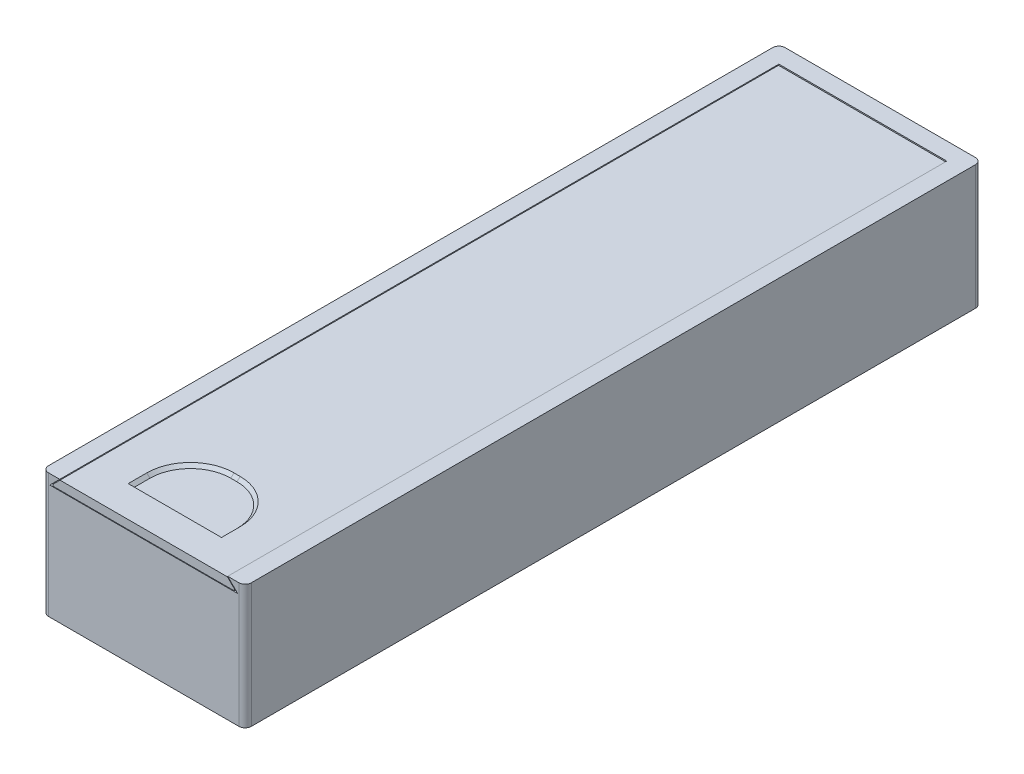
ISO-10303-21;
HEADER;
FILE_DESCRIPTION(('STEP AP214'),'2;1');
FILE_NAME('part.step','',(''),(''),'','','');
FILE_SCHEMA(('AUTOMOTIVE_DESIGN { 1 0 10303 214 1 1 1 1 }'));
ENDSEC;
DATA;
#1=APPLICATION_CONTEXT('core data for automotive mechanical design processes');
#2=APPLICATION_PROTOCOL_DEFINITION('international standard','automotive_design',2000,#1);
#3=PRODUCT_CONTEXT('',#1,'mechanical');
#4=PRODUCT('Part','Part','',(#3));
#5=PRODUCT_RELATED_PRODUCT_CATEGORY('part','',(#4));
#6=PRODUCT_DEFINITION_FORMATION('','',#4);
#7=PRODUCT_DEFINITION_CONTEXT('part definition',#1,'design');
#8=PRODUCT_DEFINITION('design','',#6,#7);
#9=PRODUCT_DEFINITION_SHAPE('','',#8);
#10=(LENGTH_UNIT() NAMED_UNIT(*) SI_UNIT(.MILLI.,.METRE.));
#11=(NAMED_UNIT(*) PLANE_ANGLE_UNIT() SI_UNIT($,.RADIAN.));
#12=(NAMED_UNIT(*) SI_UNIT($,.STERADIAN.) SOLID_ANGLE_UNIT());
#13=UNCERTAINTY_MEASURE_WITH_UNIT(LENGTH_MEASURE(1.E-05),#10,'distance_accuracy_value','');
#14=(GEOMETRIC_REPRESENTATION_CONTEXT(3) GLOBAL_UNCERTAINTY_ASSIGNED_CONTEXT((#13)) GLOBAL_UNIT_ASSIGNED_CONTEXT((#10,
#11,#12)) REPRESENTATION_CONTEXT('',''));
#15=CARTESIAN_POINT('',(0.,0.,0.));
#16=DIRECTION('',(0.,0.,1.));
#17=DIRECTION('',(1.,0.,0.));
#18=AXIS2_PLACEMENT_3D('',#15,#16,#17);
#19=CARTESIAN_POINT('',(0.,0.,2.9));
#20=DIRECTION('',(0.,0.,-1.));
#21=DIRECTION('',(-1.,0.,0.));
#22=AXIS2_PLACEMENT_3D('',#19,#20,#21);
#23=PLANE('',#22);
#24=DIRECTION('',(0.,-1.,0.));
#25=VECTOR('',#24,1.);
#26=CARTESIAN_POINT('',(14.5585786437627,8.8,2.9));
#27=LINE('',#26,#25);
#28=CARTESIAN_POINT('',(14.5585786437627,8.8,2.9));
#29=VERTEX_POINT('',#28);
#30=CARTESIAN_POINT('',(14.5585786437627,8.49999999999999,2.9));
#31=VERTEX_POINT('',#30);
#32=EDGE_CURVE('E74',#29,#31,#27,.T.);
#33=ORIENTED_EDGE('',*,*,#32,.T.);
#34=DIRECTION('',(1.,0.,0.));
#35=VECTOR('',#34,1.);
#36=CARTESIAN_POINT('',(-14.8585786437627,8.49999999999999,2.9));
#37=LINE('',#36,#35);
#38=CARTESIAN_POINT('',(-14.5585786437627,8.49999999999999,2.9));
#39=VERTEX_POINT('',#38);
#40=EDGE_CURVE('E150',#39,#31,#37,.T.);
#41=ORIENTED_EDGE('',*,*,#40,.F.);
#42=DIRECTION('',(0.,1.,0.));
#43=VECTOR('',#42,1.);
#44=CARTESIAN_POINT('',(-14.5585786437627,8.8,2.9));
#45=LINE('',#44,#43);
#46=CARTESIAN_POINT('',(-14.5585786437627,8.8,2.9));
#47=VERTEX_POINT('',#46);
#48=EDGE_CURVE('E66',#39,#47,#45,.T.);
#49=ORIENTED_EDGE('',*,*,#48,.T.);
#50=DIRECTION('',(-0.707106781186546,-0.707106781186549,0.));
#51=VECTOR('',#50,1.);
#52=CARTESIAN_POINT('',(-13.4585786437627,9.9,2.9));
#53=LINE('',#52,#51);
#54=CARTESIAN_POINT('',(-13.4585786437627,9.9,2.9));
#55=VERTEX_POINT('',#54);
#56=EDGE_CURVE('E156',#55,#47,#53,.T.);
#57=ORIENTED_EDGE('',*,*,#56,.F.);
#58=DIRECTION('',(-1.,0.,0.));
#59=VECTOR('',#58,1.);
#60=CARTESIAN_POINT('',(13.4585786437627,9.9,2.9));
#61=LINE('',#60,#59);
#62=CARTESIAN_POINT('',(13.4585786437627,9.9,2.9));
#63=VERTEX_POINT('',#62);
#64=EDGE_CURVE('E166',#63,#55,#61,.T.);
#65=ORIENTED_EDGE('',*,*,#64,.F.);
#66=DIRECTION('',(-0.707106781186547,0.707106781186548,0.));
#67=VECTOR('',#66,1.);
#68=CARTESIAN_POINT('',(14.8585786437627,8.49999999999999,2.9));
#69=LINE('',#68,#67);
#70=EDGE_CURVE('E152',#29,#63,#69,.T.);
#71=ORIENTED_EDGE('',*,*,#70,.F.);
#72=EDGE_LOOP('',(#33,#41,#49,#57,#65,#71));
#73=FACE_BOUND('',#72,.T.);
#74=ADVANCED_FACE('F49',(#73),#23,.T.);
#75=CARTESIAN_POINT('',(0.,0.,118.4));
#76=DIRECTION('',(0.,0.,1.));
#77=DIRECTION('',(1.,0.,0.));
#78=AXIS2_PLACEMENT_3D('',#75,#76,#77);
#79=PLANE('',#78);
#80=DIRECTION('',(0.,-1.,0.));
#81=VECTOR('',#80,1.);
#82=CARTESIAN_POINT('',(14.5585786437627,8.8,118.4));
#83=LINE('',#82,#81);
#84=CARTESIAN_POINT('',(14.5585786437627,8.8,118.4));
#85=VERTEX_POINT('',#84);
#86=CARTESIAN_POINT('',(14.5585786437627,8.49999999999999,118.4));
#87=VERTEX_POINT('',#86);
#88=EDGE_CURVE('E140',#85,#87,#83,.T.);
#89=ORIENTED_EDGE('',*,*,#88,.F.);
#90=DIRECTION('',(-0.707106781186547,0.707106781186548,0.));
#91=VECTOR('',#90,1.);
#92=CARTESIAN_POINT('',(14.8585786437627,8.49999999999999,118.4));
#93=LINE('',#92,#91);
#94=CARTESIAN_POINT('',(13.4585786437627,9.9,118.4));
#95=VERTEX_POINT('',#94);
#96=EDGE_CURVE('E226',#85,#95,#93,.T.);
#97=ORIENTED_EDGE('',*,*,#96,.T.);
#98=DIRECTION('',(-1.,0.,0.));
#99=VECTOR('',#98,1.);
#100=CARTESIAN_POINT('',(13.4585786437627,9.9,118.4));
#101=LINE('',#100,#99);
#102=CARTESIAN_POINT('',(-13.4585786437627,9.9,118.4));
#103=VERTEX_POINT('',#102);
#104=EDGE_CURVE('E223',#95,#103,#101,.T.);
#105=ORIENTED_EDGE('',*,*,#104,.T.);
#106=DIRECTION('',(-0.707106781186546,-0.707106781186549,0.));
#107=VECTOR('',#106,1.);
#108=CARTESIAN_POINT('',(-13.4585786437627,9.9,118.4));
#109=LINE('',#108,#107);
#110=CARTESIAN_POINT('',(-14.5585786437627,8.8,118.4));
#111=VERTEX_POINT('',#110);
#112=EDGE_CURVE('E220',#103,#111,#109,.T.);
#113=ORIENTED_EDGE('',*,*,#112,.T.);
#114=DIRECTION('',(0.,1.,0.));
#115=VECTOR('',#114,1.);
#116=CARTESIAN_POINT('',(-14.5585786437627,8.8,118.4));
#117=LINE('',#116,#115);
#118=CARTESIAN_POINT('',(-14.5585786437627,8.49999999999999,118.4));
#119=VERTEX_POINT('',#118);
#120=EDGE_CURVE('E246',#119,#111,#117,.T.);
#121=ORIENTED_EDGE('',*,*,#120,.F.);
#122=DIRECTION('',(1.,0.,0.));
#123=VECTOR('',#122,1.);
#124=CARTESIAN_POINT('',(-14.8585786437627,8.49999999999999,118.4));
#125=LINE('',#124,#123);
#126=EDGE_CURVE('E218',#119,#87,#125,.T.);
#127=ORIENTED_EDGE('',*,*,#126,.T.);
#128=EDGE_LOOP('',(#89,#97,#105,#113,#121,#127));
#129=FACE_BOUND('',#128,.T.);
#130=ADVANCED_FACE('F240',(#129),#79,.T.);
#131=CARTESIAN_POINT('',(13.4585786437627,9.9,-26.9501165922341));
#132=DIRECTION('',(0.,1.,0.));
#133=DIRECTION('',(0.,0.,1.));
#134=AXIS2_PLACEMENT_3D('',#131,#132,#133);
#135=PLANE('',#134);
#136=DIRECTION('',(0.,0.,-1.));
#137=VECTOR('',#136,1.);
#138=CARTESIAN_POINT('',(7.50000000000002,9.9,113.4));
#139=LINE('',#138,#137);
#140=CARTESIAN_POINT('',(7.50000000000002,9.9,113.4));
#141=VERTEX_POINT('',#140);
#142=CARTESIAN_POINT('',(7.50000000000002,9.9,110.4));
#143=VERTEX_POINT('',#142);
#144=EDGE_CURVE('E196',#141,#143,#139,.T.);
#145=ORIENTED_EDGE('',*,*,#144,.F.);
#146=DIRECTION('',(1.,0.,0.));
#147=VECTOR('',#146,1.);
#148=CARTESIAN_POINT('',(-7.49999999999998,9.9,113.4));
#149=LINE('',#148,#147);
#150=CARTESIAN_POINT('',(-7.49999999999998,9.9,113.4));
#151=VERTEX_POINT('',#150);
#152=EDGE_CURVE('E216',#151,#141,#149,.T.);
#153=ORIENTED_EDGE('',*,*,#152,.F.);
#154=DIRECTION('',(0.,0.,1.));
#155=VECTOR('',#154,1.);
#156=CARTESIAN_POINT('',(-7.49999999999998,9.9,113.4));
#157=LINE('',#156,#155);
#158=CARTESIAN_POINT('',(-7.49999999999998,9.9,110.4));
#159=VERTEX_POINT('',#158);
#160=EDGE_CURVE('E208',#159,#151,#157,.T.);
#161=ORIENTED_EDGE('',*,*,#160,.F.);
#162=CARTESIAN_POINT('',(-0.499999999999976,9.9,110.4));
#163=DIRECTION('',(0.,1.,0.));
#164=DIRECTION('',(0.,0.,1.));
#165=AXIS2_PLACEMENT_3D('',#162,#163,#164);
#166=CIRCLE('',#165,7.);
#167=CARTESIAN_POINT('',(-0.499999999999976,9.9,103.4));
#168=VERTEX_POINT('',#167);
#169=EDGE_CURVE('E169',#159,#168,#166,.F.);
#170=ORIENTED_EDGE('',*,*,#169,.T.);
#171=DIRECTION('',(-1.,0.,0.));
#172=VECTOR('',#171,1.);
#173=CARTESIAN_POINT('',(-7.49999999999998,9.9,103.4));
#174=LINE('',#173,#172);
#175=CARTESIAN_POINT('',(0.500000000000024,9.9,103.4));
#176=VERTEX_POINT('',#175);
#177=EDGE_CURVE('E202',#176,#168,#174,.T.);
#178=ORIENTED_EDGE('',*,*,#177,.F.);
#179=CARTESIAN_POINT('',(0.500000000000024,9.9,110.4));
#180=DIRECTION('',(0.,1.,0.));
#181=DIRECTION('',(0.,0.,1.));
#182=AXIS2_PLACEMENT_3D('',#179,#180,#181);
#183=CIRCLE('',#182,7.);
#184=EDGE_CURVE('E171',#176,#143,#183,.F.);
#185=ORIENTED_EDGE('',*,*,#184,.T.);
#186=EDGE_LOOP('',(#145,#153,#161,#170,#178,#185));
#187=FACE_BOUND('',#186,.T.);
#188=DIRECTION('',(0.,0.,1.));
#189=VECTOR('',#188,1.);
#190=CARTESIAN_POINT('',(13.4585786437627,9.9,-26.9501165922341));
#191=LINE('',#190,#189);
#192=EDGE_CURVE('E158',#63,#95,#191,.T.);
#193=ORIENTED_EDGE('',*,*,#192,.F.);
#194=ORIENTED_EDGE('',*,*,#64,.T.);
#195=DIRECTION('',(0.,0.,1.));
#196=VECTOR('',#195,1.);
#197=CARTESIAN_POINT('',(-13.4585786437627,9.9,-26.9501165922341));
#198=LINE('',#197,#196);
#199=EDGE_CURVE('E161',#55,#103,#198,.T.);
#200=ORIENTED_EDGE('',*,*,#199,.T.);
#201=ORIENTED_EDGE('',*,*,#104,.F.);
#202=EDGE_LOOP('',(#193,#194,#200,#201));
#203=FACE_BOUND('',#202,.T.);
#204=ADVANCED_FACE('F230',(#187,#203),#135,.T.);
#205=CARTESIAN_POINT('',(-13.4585786437627,9.9,-26.9501165922341));
#206=DIRECTION('',(-0.707106781186549,0.707106781186546,0.));
#207=DIRECTION('',(-0.707106781186546,-0.707106781186549,0.));
#208=AXIS2_PLACEMENT_3D('',#205,#206,#207);
#209=PLANE('',#208);
#210=DIRECTION('',(0.,0.,1.));
#211=VECTOR('',#210,1.);
#212=CARTESIAN_POINT('',(-14.5585786437627,8.8,2.47573593128807));
#213=LINE('',#212,#211);
#214=EDGE_CURVE('E237',#47,#111,#213,.T.);
#215=ORIENTED_EDGE('',*,*,#214,.T.);
#216=ORIENTED_EDGE('',*,*,#112,.F.);
#217=ORIENTED_EDGE('',*,*,#199,.F.);
#218=ORIENTED_EDGE('',*,*,#56,.T.);
#219=EDGE_LOOP('',(#215,#216,#217,#218));
#220=FACE_BOUND('',#219,.T.);
#221=ADVANCED_FACE('F236',(#220),#209,.T.);
#222=CARTESIAN_POINT('',(-14.8585786437627,8.49999999999999,-26.9501165922341));
#223=DIRECTION('',(0.,-1.,0.));
#224=DIRECTION('',(0.,0.,-1.));
#225=AXIS2_PLACEMENT_3D('',#222,#223,#224);
#226=PLANE('',#225);
#227=DIRECTION('',(0.,0.,1.));
#228=VECTOR('',#227,1.);
#229=CARTESIAN_POINT('',(14.5585786437627,8.49999999999999,2.47573593128807));
#230=LINE('',#229,#228);
#231=EDGE_CURVE('E137',#31,#87,#230,.T.);
#232=ORIENTED_EDGE('',*,*,#231,.T.);
#233=ORIENTED_EDGE('',*,*,#126,.F.);
#234=DIRECTION('',(0.,0.,1.));
#235=VECTOR('',#234,1.);
#236=CARTESIAN_POINT('',(-14.5585786437627,8.49999999999999,2.47573593128807));
#237=LINE('',#236,#235);
#238=EDGE_CURVE('E155',#39,#119,#237,.T.);
#239=ORIENTED_EDGE('',*,*,#238,.F.);
#240=ORIENTED_EDGE('',*,*,#40,.T.);
#241=EDGE_LOOP('',(#232,#233,#239,#240));
#242=FACE_BOUND('',#241,.T.);
#243=ADVANCED_FACE('F154',(#242),#226,.T.);
#244=CARTESIAN_POINT('',(14.8585786437627,8.49999999999999,-26.9501165922341));
#245=DIRECTION('',(0.707106781186548,0.707106781186547,0.));
#246=DIRECTION('',(-0.707106781186547,0.707106781186548,0.));
#247=AXIS2_PLACEMENT_3D('',#244,#245,#246);
#248=PLANE('',#247);
#249=DIRECTION('',(0.,0.,1.));
#250=VECTOR('',#249,1.);
#251=CARTESIAN_POINT('',(14.5585786437627,8.8,2.47573593128807));
#252=LINE('',#251,#250);
#253=EDGE_CURVE('E145',#29,#85,#252,.T.);
#254=ORIENTED_EDGE('',*,*,#253,.F.);
#255=ORIENTED_EDGE('',*,*,#70,.T.);
#256=ORIENTED_EDGE('',*,*,#192,.T.);
#257=ORIENTED_EDGE('',*,*,#96,.F.);
#258=EDGE_LOOP('',(#254,#255,#256,#257));
#259=FACE_BOUND('',#258,.T.);
#260=ADVANCED_FACE('F243',(#259),#248,.T.);
#261=CARTESIAN_POINT('',(-7.49999999999998,9.4,113.4));
#262=DIRECTION('',(0.,0.,1.));
#263=DIRECTION('',(1.,0.,0.));
#264=AXIS2_PLACEMENT_3D('',#261,#262,#263);
#265=PLANE('',#264);
#266=ORIENTED_EDGE('',*,*,#152,.T.);
#267=DIRECTION('',(0.707106781186561,0.707106781186534,0.));
#268=VECTOR('',#267,1.);
#269=CARTESIAN_POINT('',(7.,9.4,113.4));
#270=LINE('',#269,#268);
#271=CARTESIAN_POINT('',(7.,9.4,113.4));
#272=VERTEX_POINT('',#271);
#273=EDGE_CURVE('E13',#141,#272,#270,.F.);
#274=ORIENTED_EDGE('',*,*,#273,.T.);
#275=DIRECTION('',(1.,0.,0.));
#276=VECTOR('',#275,1.);
#277=CARTESIAN_POINT('',(-7.49999999999998,9.4,113.4));
#278=LINE('',#277,#276);
#279=CARTESIAN_POINT('',(-6.99999999999995,9.4,113.4));
#280=VERTEX_POINT('',#279);
#281=EDGE_CURVE('E211',#280,#272,#278,.T.);
#282=ORIENTED_EDGE('',*,*,#281,.F.);
#283=DIRECTION('',(0.707106781186561,-0.707106781186534,0.));
#284=VECTOR('',#283,1.);
#285=CARTESIAN_POINT('',(-6.99999999999995,9.4,113.4));
#286=LINE('',#285,#284);
#287=EDGE_CURVE('E58',#280,#151,#286,.F.);
#288=ORIENTED_EDGE('',*,*,#287,.T.);
#289=EDGE_LOOP('',(#266,#274,#282,#288));
#290=FACE_BOUND('',#289,.T.);
#291=ADVANCED_FACE('F286',(#290),#265,.F.);
#292=CARTESIAN_POINT('',(0.,9.4,0.));
#293=DIRECTION('',(0.,-1.,0.));
#294=DIRECTION('',(0.,0.,-1.));
#295=AXIS2_PLACEMENT_3D('',#292,#293,#294);
#296=PLANE('',#295);
#297=ORIENTED_EDGE('',*,*,#281,.T.);
#298=DIRECTION('',(0.,0.,-1.));
#299=VECTOR('',#298,1.);
#300=CARTESIAN_POINT('',(7.,9.4,110.4));
#301=LINE('',#300,#299);
#302=CARTESIAN_POINT('',(7.,9.4,110.4));
#303=VERTEX_POINT('',#302);
#304=EDGE_CURVE('E181',#272,#303,#301,.T.);
#305=ORIENTED_EDGE('',*,*,#304,.T.);
#306=CARTESIAN_POINT('',(0.500000000000024,9.4,110.4));
#307=DIRECTION('',(0.,-1.,0.));
#308=DIRECTION('',(0.,0.,-1.));
#309=AXIS2_PLACEMENT_3D('',#306,#307,#308);
#310=CIRCLE('',#309,6.49999999999998);
#311=CARTESIAN_POINT('',(0.500000000000024,9.4,103.9));
#312=VERTEX_POINT('',#311);
#313=EDGE_CURVE('E179',#303,#312,#310,.F.);
#314=ORIENTED_EDGE('',*,*,#313,.T.);
#315=DIRECTION('',(-1.,0.,0.));
#316=VECTOR('',#315,1.);
#317=CARTESIAN_POINT('',(-0.499999999999976,9.4,103.9));
#318=LINE('',#317,#316);
#319=CARTESIAN_POINT('',(-0.499999999999976,9.4,103.9));
#320=VERTEX_POINT('',#319);
#321=EDGE_CURVE('E177',#312,#320,#318,.T.);
#322=ORIENTED_EDGE('',*,*,#321,.T.);
#323=CARTESIAN_POINT('',(-0.499999999999976,9.4,110.4));
#324=DIRECTION('',(0.,-1.,0.));
#325=DIRECTION('',(0.,0.,-1.));
#326=AXIS2_PLACEMENT_3D('',#323,#324,#325);
#327=CIRCLE('',#326,6.49999999999997);
#328=CARTESIAN_POINT('',(-6.99999999999995,9.4,110.4));
#329=VERTEX_POINT('',#328);
#330=EDGE_CURVE('E173',#320,#329,#327,.F.);
#331=ORIENTED_EDGE('',*,*,#330,.T.);
#332=DIRECTION('',(0.,0.,1.));
#333=VECTOR('',#332,1.);
#334=CARTESIAN_POINT('',(-6.99999999999995,9.4,113.4));
#335=LINE('',#334,#333);
#336=EDGE_CURVE('E175',#329,#280,#335,.T.);
#337=ORIENTED_EDGE('',*,*,#336,.T.);
#338=EDGE_LOOP('',(#297,#305,#314,#322,#331,#337));
#339=FACE_BOUND('',#338,.T.);
#340=ADVANCED_FACE('F281',(#339),#296,.F.);
#341=CARTESIAN_POINT('',(-6.99999999999995,9.4,0.));
#342=DIRECTION('',(0.707106781186534,0.707106781186561,0.));
#343=DIRECTION('',(0.,0.,-1.));
#344=AXIS2_PLACEMENT_3D('',#341,#342,#343);
#345=PLANE('',#344);
#346=ORIENTED_EDGE('',*,*,#287,.F.);
#347=ORIENTED_EDGE('',*,*,#336,.F.);
#348=DIRECTION('',(0.707106781186561,-0.707106781186534,0.));
#349=VECTOR('',#348,1.);
#350=CARTESIAN_POINT('',(-7.49999999999998,9.90000000000001,110.4));
#351=LINE('',#350,#349);
#352=EDGE_CURVE('E53',#159,#329,#351,.T.);
#353=ORIENTED_EDGE('',*,*,#352,.F.);
#354=ORIENTED_EDGE('',*,*,#160,.T.);
#355=EDGE_LOOP('',(#346,#347,#353,#354));
#356=FACE_BOUND('',#355,.T.);
#357=ADVANCED_FACE('F51',(#356),#345,.T.);
#358=CARTESIAN_POINT('',(-0.499999999999976,9.4,110.4));
#359=DIRECTION('',(0.,1.,0.));
#360=DIRECTION('',(0.,0.,1.));
#361=AXIS2_PLACEMENT_3D('',#358,#359,#360);
#362=CONICAL_SURFACE('',#361,6.49999999999997,0.785398163397467);
#363=ORIENTED_EDGE('',*,*,#352,.T.);
#364=ORIENTED_EDGE('',*,*,#330,.F.);
#365=DIRECTION('',(0.,-0.707106781186533,0.707106781186562));
#366=VECTOR('',#365,1.);
#367=CARTESIAN_POINT('',(-0.499999999999976,9.90000000000001,103.4));
#368=LINE('',#367,#366);
#369=EDGE_CURVE('E189',#168,#320,#368,.T.);
#370=ORIENTED_EDGE('',*,*,#369,.F.);
#371=ORIENTED_EDGE('',*,*,#169,.F.);
#372=EDGE_LOOP('',(#363,#364,#370,#371));
#373=FACE_BOUND('',#372,.T.);
#374=ADVANCED_FACE('F276',(#373),#362,.F.);
#375=CARTESIAN_POINT('',(0.,9.4,103.9));
#376=DIRECTION('',(0.,0.707106781186562,0.707106781186533));
#377=DIRECTION('',(1.,0.,0.));
#378=AXIS2_PLACEMENT_3D('',#375,#376,#377);
#379=PLANE('',#378);
#380=ORIENTED_EDGE('',*,*,#369,.T.);
#381=ORIENTED_EDGE('',*,*,#321,.F.);
#382=DIRECTION('',(0.,-0.707106781186533,0.707106781186562));
#383=VECTOR('',#382,1.);
#384=CARTESIAN_POINT('',(0.500000000000024,9.90000000000001,103.4));
#385=LINE('',#384,#383);
#386=EDGE_CURVE('E187',#176,#312,#385,.T.);
#387=ORIENTED_EDGE('',*,*,#386,.F.);
#388=ORIENTED_EDGE('',*,*,#177,.T.);
#389=EDGE_LOOP('',(#380,#381,#387,#388));
#390=FACE_BOUND('',#389,.T.);
#391=ADVANCED_FACE('F273',(#390),#379,.T.);
#392=CARTESIAN_POINT('',(0.500000000000024,9.4,110.4));
#393=DIRECTION('',(0.,1.,0.));
#394=DIRECTION('',(0.,0.,1.));
#395=AXIS2_PLACEMENT_3D('',#392,#393,#394);
#396=CONICAL_SURFACE('',#395,6.49999999999998,0.785398163397463);
#397=ORIENTED_EDGE('',*,*,#386,.T.);
#398=ORIENTED_EDGE('',*,*,#313,.F.);
#399=DIRECTION('',(-0.707106781186558,-0.707106781186537,0.));
#400=VECTOR('',#399,1.);
#401=CARTESIAN_POINT('',(7.50000000000002,9.90000000000001,110.4));
#402=LINE('',#401,#400);
#403=EDGE_CURVE('E185',#143,#303,#402,.T.);
#404=ORIENTED_EDGE('',*,*,#403,.F.);
#405=ORIENTED_EDGE('',*,*,#184,.F.);
#406=EDGE_LOOP('',(#397,#398,#404,#405));
#407=FACE_BOUND('',#406,.T.);
#408=ADVANCED_FACE('F270',(#407),#396,.F.);
#409=CARTESIAN_POINT('',(7.,9.4,0.));
#410=DIRECTION('',(-0.707106781186534,0.707106781186561,0.));
#411=DIRECTION('',(0.,0.,1.));
#412=AXIS2_PLACEMENT_3D('',#409,#410,#411);
#413=PLANE('',#412);
#414=ORIENTED_EDGE('',*,*,#273,.F.);
#415=ORIENTED_EDGE('',*,*,#144,.T.);
#416=ORIENTED_EDGE('',*,*,#403,.T.);
#417=ORIENTED_EDGE('',*,*,#304,.F.);
#418=EDGE_LOOP('',(#414,#415,#416,#417));
#419=FACE_BOUND('',#418,.T.);
#420=ADVANCED_FACE('F255',(#419),#413,.T.);
#421=CARTESIAN_POINT('',(14.5585786437627,8.8,2.47573593128807));
#422=DIRECTION('',(-1.,0.,0.));
#423=DIRECTION('',(0.,0.,1.));
#424=AXIS2_PLACEMENT_3D('',#421,#422,#423);
#425=PLANE('',#424);
#426=ORIENTED_EDGE('',*,*,#253,.T.);
#427=ORIENTED_EDGE('',*,*,#88,.T.);
#428=ORIENTED_EDGE('',*,*,#231,.F.);
#429=ORIENTED_EDGE('',*,*,#32,.F.);
#430=EDGE_LOOP('',(#426,#427,#428,#429));
#431=FACE_BOUND('',#430,.T.);
#432=ADVANCED_FACE('F138',(#431),#425,.F.);
#433=CARTESIAN_POINT('',(-14.5585786437627,8.8,2.47573593128807));
#434=DIRECTION('',(1.,0.,0.));
#435=DIRECTION('',(0.,0.,-1.));
#436=AXIS2_PLACEMENT_3D('',#433,#434,#435);
#437=PLANE('',#436);
#438=ORIENTED_EDGE('',*,*,#238,.T.);
#439=ORIENTED_EDGE('',*,*,#120,.T.);
#440=ORIENTED_EDGE('',*,*,#214,.F.);
#441=ORIENTED_EDGE('',*,*,#48,.F.);
#442=EDGE_LOOP('',(#438,#439,#440,#441));
#443=FACE_BOUND('',#442,.T.);
#444=ADVANCED_FACE('F249',(#443),#437,.F.);
#445=CLOSED_SHELL('',(#74,#130,#204,#221,#243,#260,#291,#340,#357,#374,#391,#408,#420,#432,#444));
#446=MANIFOLD_SOLID_BREP('B2',#445);
#447=CARTESIAN_POINT('',(-16.3,10.,118.4));
#448=DIRECTION('',(0.,-1.,0.));
#449=DIRECTION('',(0.,0.,-1.));
#450=AXIS2_PLACEMENT_3D('',#447,#448,#449);
#451=PLANE('',#450);
#452=DIRECTION('',(-1.,0.,0.));
#453=VECTOR('',#452,1.);
#454=CARTESIAN_POINT('',(-16.3,10.,0.));
#455=LINE('',#454,#453);
#456=CARTESIAN_POINT('',(15.3,10.,0.));
#457=VERTEX_POINT('',#456);
#458=CARTESIAN_POINT('',(-15.3,10.,0.));
#459=VERTEX_POINT('',#458);
#460=EDGE_CURVE('E537',#457,#459,#455,.T.);
#461=ORIENTED_EDGE('',*,*,#460,.T.);
#462=CARTESIAN_POINT('',(-15.3,10.,1.));
#463=DIRECTION('',(0.,-1.,0.));
#464=DIRECTION('',(0.,0.,-1.));
#465=AXIS2_PLACEMENT_3D('',#462,#463,#464);
#466=CIRCLE('',#465,1.);
#467=CARTESIAN_POINT('',(-16.3,10.,1.));
#468=VERTEX_POINT('',#467);
#469=EDGE_CURVE('E584',#459,#468,#466,.F.);
#470=ORIENTED_EDGE('',*,*,#469,.T.);
#471=DIRECTION('',(0.,0.,-1.));
#472=VECTOR('',#471,1.);
#473=CARTESIAN_POINT('',(-16.3,10.,118.4));
#474=LINE('',#473,#472);
#475=CARTESIAN_POINT('',(-16.3,10.,117.4));
#476=VERTEX_POINT('',#475);
#477=EDGE_CURVE('E558',#476,#468,#474,.T.);
#478=ORIENTED_EDGE('',*,*,#477,.F.);
#479=CARTESIAN_POINT('',(-15.3,10.,117.4));
#480=DIRECTION('',(0.,-1.,0.));
#481=DIRECTION('',(0.,0.,-1.));
#482=AXIS2_PLACEMENT_3D('',#479,#480,#481);
#483=CIRCLE('',#482,1.);
#484=CARTESIAN_POINT('',(-15.3,10.,118.4));
#485=VERTEX_POINT('',#484);
#486=EDGE_CURVE('E581',#476,#485,#483,.F.);
#487=ORIENTED_EDGE('',*,*,#486,.T.);
#488=DIRECTION('',(-1.,0.,0.));
#489=VECTOR('',#488,1.);
#490=CARTESIAN_POINT('',(-16.3,10.,118.4));
#491=LINE('',#490,#489);
#492=CARTESIAN_POINT('',(-13.5,10.,118.4));
#493=VERTEX_POINT('',#492);
#494=EDGE_CURVE('E533',#493,#485,#491,.T.);
#495=ORIENTED_EDGE('',*,*,#494,.F.);
#496=DIRECTION('',(0.,0.,-1.));
#497=VECTOR('',#496,1.);
#498=CARTESIAN_POINT('',(-13.5,10.,118.4));
#499=LINE('',#498,#497);
#500=CARTESIAN_POINT('',(-13.5,10.,2.8));
#501=VERTEX_POINT('',#500);
#502=EDGE_CURVE('E512',#493,#501,#499,.T.);
#503=ORIENTED_EDGE('',*,*,#502,.T.);
#504=DIRECTION('',(-1.,0.,0.));
#505=VECTOR('',#504,1.);
#506=CARTESIAN_POINT('',(0.,10.,2.8));
#507=LINE('',#506,#505);
#508=CARTESIAN_POINT('',(13.5,10.,2.8));
#509=VERTEX_POINT('',#508);
#510=EDGE_CURVE('E520',#509,#501,#507,.T.);
#511=ORIENTED_EDGE('',*,*,#510,.F.);
#512=DIRECTION('',(0.,0.,-1.));
#513=VECTOR('',#512,1.);
#514=CARTESIAN_POINT('',(13.5,10.,118.4));
#515=LINE('',#514,#513);
#516=CARTESIAN_POINT('',(13.5,10.,118.4));
#517=VERTEX_POINT('',#516);
#518=EDGE_CURVE('E534',#517,#509,#515,.T.);
#519=ORIENTED_EDGE('',*,*,#518,.F.);
#520=CARTESIAN_POINT('',(15.3,10.,118.4));
#521=VERTEX_POINT('',#520);
#522=EDGE_CURVE('E543',#521,#517,#491,.T.);
#523=ORIENTED_EDGE('',*,*,#522,.F.);
#524=CARTESIAN_POINT('',(15.3,10.,117.4));
#525=DIRECTION('',(0.,-1.,0.));
#526=DIRECTION('',(0.,0.,-1.));
#527=AXIS2_PLACEMENT_3D('',#524,#525,#526);
#528=CIRCLE('',#527,1.);
#529=CARTESIAN_POINT('',(16.3,10.,117.4));
#530=VERTEX_POINT('',#529);
#531=EDGE_CURVE('E415',#521,#530,#528,.F.);
#532=ORIENTED_EDGE('',*,*,#531,.T.);
#533=DIRECTION('',(0.,0.,-1.));
#534=VECTOR('',#533,1.);
#535=CARTESIAN_POINT('',(16.3,10.,118.4));
#536=LINE('',#535,#534);
#537=CARTESIAN_POINT('',(16.3,10.,1.));
#538=VERTEX_POINT('',#537);
#539=EDGE_CURVE('E561',#530,#538,#536,.T.);
#540=ORIENTED_EDGE('',*,*,#539,.T.);
#541=CARTESIAN_POINT('',(15.3,10.,1.));
#542=DIRECTION('',(0.,-1.,0.));
#543=DIRECTION('',(0.,0.,-1.));
#544=AXIS2_PLACEMENT_3D('',#541,#542,#543);
#545=CIRCLE('',#544,1.);
#546=EDGE_CURVE('E407',#538,#457,#545,.F.);
#547=ORIENTED_EDGE('',*,*,#546,.T.);
#548=EDGE_LOOP('',(#461,#470,#478,#487,#495,#503,#511,#519,#523,#532,#540,#547));
#549=FACE_BOUND('',#548,.T.);
#550=ADVANCED_FACE('F392',(#549),#451,.F.);
#551=CARTESIAN_POINT('',(16.3,-10.,118.4));
#552=DIRECTION('',(-1.,0.,0.));
#553=DIRECTION('',(0.,0.,1.));
#554=AXIS2_PLACEMENT_3D('',#551,#552,#553);
#555=PLANE('',#554);
#556=DIRECTION('',(0.,0.,-1.));
#557=VECTOR('',#556,1.);
#558=CARTESIAN_POINT('',(16.3,-10.,118.4));
#559=LINE('',#558,#557);
#560=CARTESIAN_POINT('',(16.3,-10.,117.4));
#561=VERTEX_POINT('',#560);
#562=CARTESIAN_POINT('',(16.3,-10.,1.));
#563=VERTEX_POINT('',#562);
#564=EDGE_CURVE('E548',#561,#563,#559,.T.);
#565=ORIENTED_EDGE('',*,*,#564,.T.);
#566=DIRECTION('',(0.,1.,0.));
#567=VECTOR('',#566,1.);
#568=CARTESIAN_POINT('',(16.3,10.,1.));
#569=LINE('',#568,#567);
#570=EDGE_CURVE('E588',#563,#538,#569,.T.);
#571=ORIENTED_EDGE('',*,*,#570,.T.);
#572=ORIENTED_EDGE('',*,*,#539,.F.);
#573=DIRECTION('',(0.,1.,0.));
#574=VECTOR('',#573,1.);
#575=CARTESIAN_POINT('',(16.3,-10.,117.4));
#576=LINE('',#575,#574);
#577=EDGE_CURVE('E586',#530,#561,#576,.F.);
#578=ORIENTED_EDGE('',*,*,#577,.T.);
#579=EDGE_LOOP('',(#565,#571,#572,#578));
#580=FACE_BOUND('',#579,.T.);
#581=ADVANCED_FACE('F679',(#580),#555,.F.);
#582=CARTESIAN_POINT('',(-16.3,-10.,118.4));
#583=DIRECTION('',(1.,0.,0.));
#584=DIRECTION('',(0.,0.,-1.));
#585=AXIS2_PLACEMENT_3D('',#582,#583,#584);
#586=PLANE('',#585);
#587=ORIENTED_EDGE('',*,*,#477,.T.);
#588=DIRECTION('',(0.,-1.,0.));
#589=VECTOR('',#588,1.);
#590=CARTESIAN_POINT('',(-16.3,-10.,1.));
#591=LINE('',#590,#589);
#592=CARTESIAN_POINT('',(-16.3,-10.,1.));
#593=VERTEX_POINT('',#592);
#594=EDGE_CURVE('E565',#468,#593,#591,.T.);
#595=ORIENTED_EDGE('',*,*,#594,.T.);
#596=DIRECTION('',(0.,0.,-1.));
#597=VECTOR('',#596,1.);
#598=CARTESIAN_POINT('',(-16.3,-10.,118.4));
#599=LINE('',#598,#597);
#600=CARTESIAN_POINT('',(-16.3,-10.,117.4));
#601=VERTEX_POINT('',#600);
#602=EDGE_CURVE('E555',#601,#593,#599,.T.);
#603=ORIENTED_EDGE('',*,*,#602,.F.);
#604=DIRECTION('',(0.,-1.,0.));
#605=VECTOR('',#604,1.);
#606=CARTESIAN_POINT('',(-16.3,-10.,117.4));
#607=LINE('',#606,#605);
#608=EDGE_CURVE('E563',#601,#476,#607,.F.);
#609=ORIENTED_EDGE('',*,*,#608,.T.);
#610=EDGE_LOOP('',(#587,#595,#603,#609));
#611=FACE_BOUND('',#610,.T.);
#612=ADVANCED_FACE('F664',(#611),#586,.F.);
#613=CARTESIAN_POINT('',(-16.3,-10.,118.4));
#614=DIRECTION('',(0.,1.,0.));
#615=DIRECTION('',(0.,0.,1.));
#616=AXIS2_PLACEMENT_3D('',#613,#614,#615);
#617=PLANE('',#616);
#618=ORIENTED_EDGE('',*,*,#602,.T.);
#619=CARTESIAN_POINT('',(-15.3,-10.,1.));
#620=DIRECTION('',(0.,1.,0.));
#621=DIRECTION('',(0.,0.,1.));
#622=AXIS2_PLACEMENT_3D('',#619,#620,#621);
#623=CIRCLE('',#622,1.);
#624=CARTESIAN_POINT('',(-15.3,-10.,0.));
#625=VERTEX_POINT('',#624);
#626=EDGE_CURVE('E574',#593,#625,#623,.F.);
#627=ORIENTED_EDGE('',*,*,#626,.T.);
#628=DIRECTION('',(1.,0.,0.));
#629=VECTOR('',#628,1.);
#630=CARTESIAN_POINT('',(-16.3,-10.,0.));
#631=LINE('',#630,#629);
#632=CARTESIAN_POINT('',(15.3,-10.,0.));
#633=VERTEX_POINT('',#632);
#634=EDGE_CURVE('E550',#625,#633,#631,.T.);
#635=ORIENTED_EDGE('',*,*,#634,.T.);
#636=CARTESIAN_POINT('',(15.3,-10.,1.));
#637=DIRECTION('',(0.,1.,0.));
#638=DIRECTION('',(0.,0.,1.));
#639=AXIS2_PLACEMENT_3D('',#636,#637,#638);
#640=CIRCLE('',#639,1.);
#641=EDGE_CURVE('E572',#633,#563,#640,.F.);
#642=ORIENTED_EDGE('',*,*,#641,.T.);
#643=ORIENTED_EDGE('',*,*,#564,.F.);
#644=CARTESIAN_POINT('',(15.3,-10.,117.4));
#645=DIRECTION('',(0.,1.,0.));
#646=DIRECTION('',(0.,0.,1.));
#647=AXIS2_PLACEMENT_3D('',#644,#645,#646);
#648=CIRCLE('',#647,1.);
#649=CARTESIAN_POINT('',(15.3,-10.,118.4));
#650=VERTEX_POINT('',#649);
#651=EDGE_CURVE('E568',#561,#650,#648,.F.);
#652=ORIENTED_EDGE('',*,*,#651,.T.);
#653=DIRECTION('',(1.,0.,0.));
#654=VECTOR('',#653,1.);
#655=CARTESIAN_POINT('',(-16.3,-10.,118.4));
#656=LINE('',#655,#654);
#657=CARTESIAN_POINT('',(-15.3,-10.,118.4));
#658=VERTEX_POINT('',#657);
#659=EDGE_CURVE('E545',#658,#650,#656,.T.);
#660=ORIENTED_EDGE('',*,*,#659,.F.);
#661=CARTESIAN_POINT('',(-15.3,-10.,117.4));
#662=DIRECTION('',(0.,1.,0.));
#663=DIRECTION('',(0.,0.,1.));
#664=AXIS2_PLACEMENT_3D('',#661,#662,#663);
#665=CIRCLE('',#664,1.);
#666=EDGE_CURVE('E570',#658,#601,#665,.F.);
#667=ORIENTED_EDGE('',*,*,#666,.T.);
#668=EDGE_LOOP('',(#618,#627,#635,#642,#643,#652,#660,#667));
#669=FACE_BOUND('',#668,.T.);
#670=ADVANCED_FACE('F662',(#669),#617,.F.);
#671=CARTESIAN_POINT('',(0.,0.,118.4));
#672=DIRECTION('',(0.,0.,-1.));
#673=DIRECTION('',(-1.,0.,0.));
#674=AXIS2_PLACEMENT_3D('',#671,#672,#673);
#675=PLANE('',#674);
#676=ORIENTED_EDGE('',*,*,#494,.T.);
#677=DIRECTION('',(0.,-1.,0.));
#678=VECTOR('',#677,1.);
#679=CARTESIAN_POINT('',(-15.3,0.,118.4));
#680=LINE('',#679,#678);
#681=EDGE_CURVE('E47',#485,#658,#680,.T.);
#682=ORIENTED_EDGE('',*,*,#681,.T.);
#683=ORIENTED_EDGE('',*,*,#659,.T.);
#684=DIRECTION('',(0.,1.,0.));
#685=VECTOR('',#684,1.);
#686=CARTESIAN_POINT('',(15.3,0.,118.4));
#687=LINE('',#686,#685);
#688=EDGE_CURVE('E400',#650,#521,#687,.T.);
#689=ORIENTED_EDGE('',*,*,#688,.T.);
#690=ORIENTED_EDGE('',*,*,#522,.T.);
#691=DIRECTION('',(-0.707106781186547,0.707106781186548,0.));
#692=VECTOR('',#691,1.);
#693=CARTESIAN_POINT('',(15.1,8.4,118.4));
#694=LINE('',#693,#692);
#695=CARTESIAN_POINT('',(15.1,8.4,118.4));
#696=VERTEX_POINT('',#695);
#697=EDGE_CURVE('E599',#696,#517,#694,.T.);
#698=ORIENTED_EDGE('',*,*,#697,.F.);
#699=DIRECTION('',(1.,0.,0.));
#700=VECTOR('',#699,1.);
#701=CARTESIAN_POINT('',(-15.1,8.4,118.4));
#702=LINE('',#701,#700);
#703=CARTESIAN_POINT('',(-15.1,8.4,118.4));
#704=VERTEX_POINT('',#703);
#705=EDGE_CURVE('E517',#704,#696,#702,.T.);
#706=ORIENTED_EDGE('',*,*,#705,.F.);
#707=DIRECTION('',(-0.707106781186546,-0.707106781186549,0.));
#708=VECTOR('',#707,1.);
#709=CARTESIAN_POINT('',(-13.5,10.,118.4));
#710=LINE('',#709,#708);
#711=EDGE_CURVE('E605',#493,#704,#710,.T.);
#712=ORIENTED_EDGE('',*,*,#711,.F.);
#713=EDGE_LOOP('',(#676,#682,#683,#689,#690,#698,#706,#712));
#714=FACE_BOUND('',#713,.T.);
#715=ADVANCED_FACE('F592',(#714),#675,.F.);
#716=CARTESIAN_POINT('',(0.,0.,0.));
#717=DIRECTION('',(0.,0.,-1.));
#718=DIRECTION('',(-1.,0.,0.));
#719=AXIS2_PLACEMENT_3D('',#716,#717,#718);
#720=PLANE('',#719);
#721=ORIENTED_EDGE('',*,*,#634,.F.);
#722=DIRECTION('',(0.,-1.,0.));
#723=VECTOR('',#722,1.);
#724=CARTESIAN_POINT('',(-15.3,10.,0.));
#725=LINE('',#724,#723);
#726=EDGE_CURVE('E578',#625,#459,#725,.F.);
#727=ORIENTED_EDGE('',*,*,#726,.T.);
#728=ORIENTED_EDGE('',*,*,#460,.F.);
#729=DIRECTION('',(0.,1.,0.));
#730=VECTOR('',#729,1.);
#731=CARTESIAN_POINT('',(15.3,-10.,0.));
#732=LINE('',#731,#730);
#733=EDGE_CURVE('E576',#457,#633,#732,.F.);
#734=ORIENTED_EDGE('',*,*,#733,.T.);
#735=EDGE_LOOP('',(#721,#727,#728,#734));
#736=FACE_BOUND('',#735,.T.);
#737=ADVANCED_FACE('F674',(#736),#720,.T.);
#738=CARTESIAN_POINT('',(13.5,-10.,118.4));
#739=DIRECTION('',(-1.,0.,0.));
#740=DIRECTION('',(0.,0.,1.));
#741=AXIS2_PLACEMENT_3D('',#738,#739,#740);
#742=PLANE('',#741);
#743=DIRECTION('',(0.,0.,1.));
#744=VECTOR('',#743,1.);
#745=CARTESIAN_POINT('',(13.5,8.39999999999999,118.4));
#746=LINE('',#745,#744);
#747=CARTESIAN_POINT('',(13.5,8.4,2.8));
#748=VERTEX_POINT('',#747);
#749=CARTESIAN_POINT('',(13.5,8.4,115.6));
#750=VERTEX_POINT('',#749);
#751=EDGE_CURVE('E620',#748,#750,#746,.T.);
#752=ORIENTED_EDGE('',*,*,#751,.F.);
#753=DIRECTION('',(0.,1.,0.));
#754=VECTOR('',#753,1.);
#755=CARTESIAN_POINT('',(13.5,0.,2.8));
#756=LINE('',#755,#754);
#757=CARTESIAN_POINT('',(13.5,-7.2,2.8));
#758=VERTEX_POINT('',#757);
#759=EDGE_CURVE('E528',#758,#748,#756,.T.);
#760=ORIENTED_EDGE('',*,*,#759,.F.);
#761=DIRECTION('',(0.,0.,-1.));
#762=VECTOR('',#761,1.);
#763=CARTESIAN_POINT('',(13.5,-7.2,118.4));
#764=LINE('',#763,#762);
#765=CARTESIAN_POINT('',(13.5,-7.2,115.6));
#766=VERTEX_POINT('',#765);
#767=EDGE_CURVE('E540',#766,#758,#764,.T.);
#768=ORIENTED_EDGE('',*,*,#767,.F.);
#769=DIRECTION('',(0.,1.,0.));
#770=VECTOR('',#769,1.);
#771=CARTESIAN_POINT('',(13.5,0.,115.6));
#772=LINE('',#771,#770);
#773=EDGE_CURVE('E623',#766,#750,#772,.T.);
#774=ORIENTED_EDGE('',*,*,#773,.T.);
#775=EDGE_LOOP('',(#752,#760,#768,#774));
#776=FACE_BOUND('',#775,.T.);
#777=ADVANCED_FACE('F651',(#776),#742,.T.);
#778=CARTESIAN_POINT('',(-13.5,-10.,118.4));
#779=DIRECTION('',(1.,0.,0.));
#780=DIRECTION('',(0.,0.,-1.));
#781=AXIS2_PLACEMENT_3D('',#778,#779,#780);
#782=PLANE('',#781);
#783=DIRECTION('',(0.,0.,-1.));
#784=VECTOR('',#783,1.);
#785=CARTESIAN_POINT('',(-13.5,8.39999999999999,118.4));
#786=LINE('',#785,#784);
#787=CARTESIAN_POINT('',(-13.5,8.4,115.6));
#788=VERTEX_POINT('',#787);
#789=CARTESIAN_POINT('',(-13.5,8.4,2.8));
#790=VERTEX_POINT('',#789);
#791=EDGE_CURVE('E618',#788,#790,#786,.T.);
#792=ORIENTED_EDGE('',*,*,#791,.F.);
#793=DIRECTION('',(0.,-1.,0.));
#794=VECTOR('',#793,1.);
#795=CARTESIAN_POINT('',(-13.5,0.,115.6));
#796=LINE('',#795,#794);
#797=CARTESIAN_POINT('',(-13.5,-7.2,115.6));
#798=VERTEX_POINT('',#797);
#799=EDGE_CURVE('E626',#788,#798,#796,.T.);
#800=ORIENTED_EDGE('',*,*,#799,.T.);
#801=DIRECTION('',(0.,0.,-1.));
#802=VECTOR('',#801,1.);
#803=CARTESIAN_POINT('',(-13.5,-7.2,118.4));
#804=LINE('',#803,#802);
#805=CARTESIAN_POINT('',(-13.5,-7.2,2.8));
#806=VERTEX_POINT('',#805);
#807=EDGE_CURVE('E535',#798,#806,#804,.T.);
#808=ORIENTED_EDGE('',*,*,#807,.T.);
#809=DIRECTION('',(0.,-1.,0.));
#810=VECTOR('',#809,1.);
#811=CARTESIAN_POINT('',(-13.5,0.,2.8));
#812=LINE('',#811,#810);
#813=EDGE_CURVE('E527',#790,#806,#812,.T.);
#814=ORIENTED_EDGE('',*,*,#813,.F.);
#815=EDGE_LOOP('',(#792,#800,#808,#814));
#816=FACE_BOUND('',#815,.T.);
#817=ADVANCED_FACE('F638',(#816),#782,.T.);
#818=CARTESIAN_POINT('',(-16.3,-7.2,118.4));
#819=DIRECTION('',(0.,1.,0.));
#820=DIRECTION('',(0.,0.,1.));
#821=AXIS2_PLACEMENT_3D('',#818,#819,#820);
#822=PLANE('',#821);
#823=DIRECTION('',(1.,0.,0.));
#824=VECTOR('',#823,1.);
#825=CARTESIAN_POINT('',(0.,-7.2,2.8));
#826=LINE('',#825,#824);
#827=EDGE_CURVE('E627',#806,#758,#826,.T.);
#828=ORIENTED_EDGE('',*,*,#827,.F.);
#829=ORIENTED_EDGE('',*,*,#807,.F.);
#830=DIRECTION('',(1.,0.,0.));
#831=VECTOR('',#830,1.);
#832=CARTESIAN_POINT('',(0.,-7.2,115.6));
#833=LINE('',#832,#831);
#834=EDGE_CURVE('E630',#798,#766,#833,.T.);
#835=ORIENTED_EDGE('',*,*,#834,.T.);
#836=ORIENTED_EDGE('',*,*,#767,.T.);
#837=EDGE_LOOP('',(#828,#829,#835,#836));
#838=FACE_BOUND('',#837,.T.);
#839=ADVANCED_FACE('F645',(#838),#822,.T.);
#840=CARTESIAN_POINT('',(0.,0.,115.6));
#841=DIRECTION('',(0.,0.,-1.));
#842=DIRECTION('',(-1.,0.,0.));
#843=AXIS2_PLACEMENT_3D('',#840,#841,#842);
#844=PLANE('',#843);
#845=DIRECTION('',(-1.,0.,0.));
#846=VECTOR('',#845,1.);
#847=CARTESIAN_POINT('',(0.,8.4,115.6));
#848=LINE('',#847,#846);
#849=EDGE_CURVE('E611',#750,#788,#848,.T.);
#850=ORIENTED_EDGE('',*,*,#849,.F.);
#851=ORIENTED_EDGE('',*,*,#773,.F.);
#852=ORIENTED_EDGE('',*,*,#834,.F.);
#853=ORIENTED_EDGE('',*,*,#799,.F.);
#854=EDGE_LOOP('',(#850,#851,#852,#853));
#855=FACE_BOUND('',#854,.T.);
#856=ADVANCED_FACE('F648',(#855),#844,.T.);
#857=CARTESIAN_POINT('',(0.,0.,2.8));
#858=DIRECTION('',(0.,0.,-1.));
#859=DIRECTION('',(-1.,0.,0.));
#860=AXIS2_PLACEMENT_3D('',#857,#858,#859);
#861=PLANE('',#860);
#862=ORIENTED_EDGE('',*,*,#759,.T.);
#863=DIRECTION('',(1.,0.,0.));
#864=VECTOR('',#863,1.);
#865=CARTESIAN_POINT('',(-15.1,8.4,2.8));
#866=LINE('',#865,#864);
#867=CARTESIAN_POINT('',(15.1,8.4,2.8));
#868=VERTEX_POINT('',#867);
#869=EDGE_CURVE('E613',#748,#868,#866,.T.);
#870=ORIENTED_EDGE('',*,*,#869,.T.);
#871=DIRECTION('',(-0.707106781186547,0.707106781186548,0.));
#872=VECTOR('',#871,1.);
#873=CARTESIAN_POINT('',(15.1,8.4,2.8));
#874=LINE('',#873,#872);
#875=EDGE_CURVE('E524',#868,#509,#874,.T.);
#876=ORIENTED_EDGE('',*,*,#875,.T.);
#877=ORIENTED_EDGE('',*,*,#510,.T.);
#878=DIRECTION('',(-0.707106781186546,-0.707106781186549,0.));
#879=VECTOR('',#878,1.);
#880=CARTESIAN_POINT('',(-13.5,10.,2.8));
#881=LINE('',#880,#879);
#882=CARTESIAN_POINT('',(-15.1,8.4,2.8));
#883=VERTEX_POINT('',#882);
#884=EDGE_CURVE('E507',#501,#883,#881,.T.);
#885=ORIENTED_EDGE('',*,*,#884,.T.);
#886=EDGE_CURVE('E612',#883,#790,#866,.T.);
#887=ORIENTED_EDGE('',*,*,#886,.T.);
#888=ORIENTED_EDGE('',*,*,#813,.T.);
#889=ORIENTED_EDGE('',*,*,#827,.T.);
#890=EDGE_LOOP('',(#862,#870,#876,#877,#885,#887,#888,#889));
#891=FACE_BOUND('',#890,.T.);
#892=ADVANCED_FACE('F522',(#891),#861,.F.);
#893=CARTESIAN_POINT('',(-13.5,10.,-27.4423544057006));
#894=DIRECTION('',(-0.707106781186549,0.707106781186546,0.));
#895=DIRECTION('',(-0.707106781186546,-0.707106781186549,0.));
#896=AXIS2_PLACEMENT_3D('',#893,#894,#895);
#897=PLANE('',#896);
#898=ORIENTED_EDGE('',*,*,#502,.F.);
#899=ORIENTED_EDGE('',*,*,#711,.T.);
#900=DIRECTION('',(0.,0.,1.));
#901=VECTOR('',#900,1.);
#902=CARTESIAN_POINT('',(-15.1,8.4,-27.4423544057006));
#903=LINE('',#902,#901);
#904=EDGE_CURVE('E514',#883,#704,#903,.T.);
#905=ORIENTED_EDGE('',*,*,#904,.F.);
#906=ORIENTED_EDGE('',*,*,#884,.F.);
#907=EDGE_LOOP('',(#898,#899,#905,#906));
#908=FACE_BOUND('',#907,.T.);
#909=ADVANCED_FACE('F509',(#908),#897,.F.);
#910=CARTESIAN_POINT('',(-15.1,8.4,-27.4423544057006));
#911=DIRECTION('',(0.,-1.,0.));
#912=DIRECTION('',(0.,0.,-1.));
#913=AXIS2_PLACEMENT_3D('',#910,#911,#912);
#914=PLANE('',#913);
#915=ORIENTED_EDGE('',*,*,#751,.T.);
#916=ORIENTED_EDGE('',*,*,#849,.T.);
#917=ORIENTED_EDGE('',*,*,#791,.T.);
#918=ORIENTED_EDGE('',*,*,#886,.F.);
#919=ORIENTED_EDGE('',*,*,#904,.T.);
#920=ORIENTED_EDGE('',*,*,#705,.T.);
#921=DIRECTION('',(0.,0.,1.));
#922=VECTOR('',#921,1.);
#923=CARTESIAN_POINT('',(15.1,8.4,-27.4423544057006));
#924=LINE('',#923,#922);
#925=EDGE_CURVE('E602',#868,#696,#924,.T.);
#926=ORIENTED_EDGE('',*,*,#925,.F.);
#927=ORIENTED_EDGE('',*,*,#869,.F.);
#928=EDGE_LOOP('',(#915,#916,#917,#918,#919,#920,#926,#927));
#929=FACE_BOUND('',#928,.T.);
#930=ADVANCED_FACE('F654',(#929),#914,.F.);
#931=CARTESIAN_POINT('',(15.1,8.4,-27.4423544057006));
#932=DIRECTION('',(0.707106781186548,0.707106781186547,0.));
#933=DIRECTION('',(-0.707106781186547,0.707106781186548,0.));
#934=AXIS2_PLACEMENT_3D('',#931,#932,#933);
#935=PLANE('',#934);
#936=ORIENTED_EDGE('',*,*,#925,.T.);
#937=ORIENTED_EDGE('',*,*,#697,.T.);
#938=ORIENTED_EDGE('',*,*,#518,.T.);
#939=ORIENTED_EDGE('',*,*,#875,.F.);
#940=EDGE_LOOP('',(#936,#937,#938,#939));
#941=FACE_BOUND('',#940,.T.);
#942=ADVANCED_FACE('F600',(#941),#935,.F.);
#943=CARTESIAN_POINT('',(-15.3,-10.,1.));
#944=DIRECTION('',(0.,1.,0.));
#945=DIRECTION('',(0.,0.,1.));
#946=AXIS2_PLACEMENT_3D('',#943,#944,#945);
#947=CYLINDRICAL_SURFACE('',#946,1.);
#948=ORIENTED_EDGE('',*,*,#469,.F.);
#949=ORIENTED_EDGE('',*,*,#726,.F.);
#950=ORIENTED_EDGE('',*,*,#626,.F.);
#951=ORIENTED_EDGE('',*,*,#594,.F.);
#952=EDGE_LOOP('',(#948,#949,#950,#951));
#953=FACE_BOUND('',#952,.T.);
#954=ADVANCED_FACE('F669',(#953),#947,.T.);
#955=CARTESIAN_POINT('',(15.3,-10.,1.));
#956=DIRECTION('',(0.,-1.,0.));
#957=DIRECTION('',(0.,0.,-1.));
#958=AXIS2_PLACEMENT_3D('',#955,#956,#957);
#959=CYLINDRICAL_SURFACE('',#958,1.);
#960=ORIENTED_EDGE('',*,*,#641,.F.);
#961=ORIENTED_EDGE('',*,*,#733,.F.);
#962=ORIENTED_EDGE('',*,*,#546,.F.);
#963=ORIENTED_EDGE('',*,*,#570,.F.);
#964=EDGE_LOOP('',(#960,#961,#962,#963));
#965=FACE_BOUND('',#964,.T.);
#966=ADVANCED_FACE('F676',(#965),#959,.T.);
#967=CARTESIAN_POINT('',(-15.3,0.,117.4));
#968=DIRECTION('',(0.,-1.,0.));
#969=DIRECTION('',(0.,0.,-1.));
#970=AXIS2_PLACEMENT_3D('',#967,#968,#969);
#971=CYLINDRICAL_SURFACE('',#970,1.);
#972=ORIENTED_EDGE('',*,*,#486,.F.);
#973=ORIENTED_EDGE('',*,*,#608,.F.);
#974=ORIENTED_EDGE('',*,*,#666,.F.);
#975=ORIENTED_EDGE('',*,*,#681,.F.);
#976=EDGE_LOOP('',(#972,#973,#974,#975));
#977=FACE_BOUND('',#976,.T.);
#978=ADVANCED_FACE('F658',(#977),#971,.T.);
#979=CARTESIAN_POINT('',(15.3,0.,117.4));
#980=DIRECTION('',(0.,1.,0.));
#981=DIRECTION('',(0.,0.,1.));
#982=AXIS2_PLACEMENT_3D('',#979,#980,#981);
#983=CYLINDRICAL_SURFACE('',#982,1.);
#984=ORIENTED_EDGE('',*,*,#651,.F.);
#985=ORIENTED_EDGE('',*,*,#577,.F.);
#986=ORIENTED_EDGE('',*,*,#531,.F.);
#987=ORIENTED_EDGE('',*,*,#688,.F.);
#988=EDGE_LOOP('',(#984,#985,#986,#987));
#989=FACE_BOUND('',#988,.T.);
#990=ADVANCED_FACE('F394',(#989),#983,.T.);
#991=CLOSED_SHELL('',(#550,#581,#612,#670,#715,#737,#777,#817,#839,#856,#892,#909,#930,#942,
#954,#966,#978,#990));
#992=MANIFOLD_SOLID_BREP('B7_NOT_SHOWN',#991);
#993=ADVANCED_BREP_SHAPE_REPRESENTATION('',(#18,#446,#992),#14);
#994=SHAPE_DEFINITION_REPRESENTATION(#9,#993);
ENDSEC;
END-ISO-10303-21;
